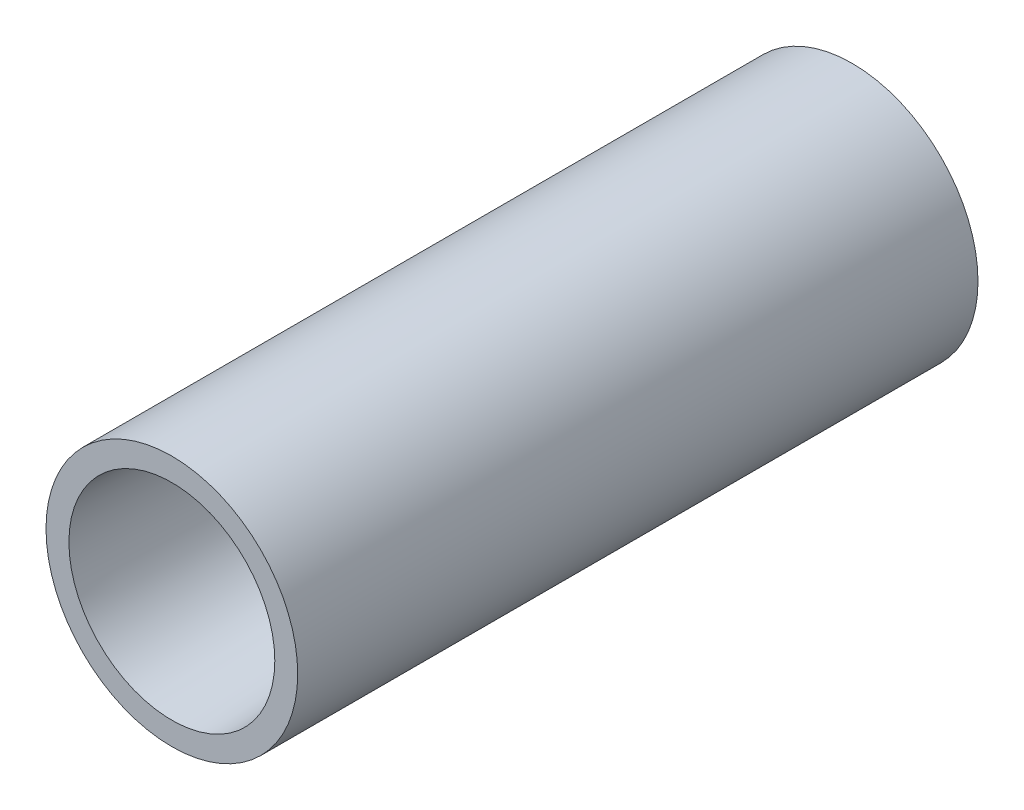
ISO-10303-21;
HEADER;
FILE_DESCRIPTION(('STEP AP214'),'2;1');
FILE_NAME('part.step','',(''),(''),'','','');
FILE_SCHEMA(('AUTOMOTIVE_DESIGN { 1 0 10303 214 1 1 1 1 }'));
ENDSEC;
DATA;
#1=APPLICATION_CONTEXT('core data for automotive mechanical design processes');
#2=APPLICATION_PROTOCOL_DEFINITION('international standard','automotive_design',2000,#1);
#3=PRODUCT_CONTEXT('',#1,'mechanical');
#4=PRODUCT('Part','Part','',(#3));
#5=PRODUCT_RELATED_PRODUCT_CATEGORY('part','',(#4));
#6=PRODUCT_DEFINITION_FORMATION('','',#4);
#7=PRODUCT_DEFINITION_CONTEXT('part definition',#1,'design');
#8=PRODUCT_DEFINITION('design','',#6,#7);
#9=PRODUCT_DEFINITION_SHAPE('','',#8);
#10=(LENGTH_UNIT() NAMED_UNIT(*) SI_UNIT(.MILLI.,.METRE.));
#11=(NAMED_UNIT(*) PLANE_ANGLE_UNIT() SI_UNIT($,.RADIAN.));
#12=(NAMED_UNIT(*) SI_UNIT($,.STERADIAN.) SOLID_ANGLE_UNIT());
#13=UNCERTAINTY_MEASURE_WITH_UNIT(LENGTH_MEASURE(1.E-05),#10,'distance_accuracy_value','');
#14=(GEOMETRIC_REPRESENTATION_CONTEXT(3) GLOBAL_UNCERTAINTY_ASSIGNED_CONTEXT((#13)) GLOBAL_UNIT_ASSIGNED_CONTEXT((#10,
#11,#12)) REPRESENTATION_CONTEXT('',''));
#15=CARTESIAN_POINT('',(0.,0.,0.));
#16=DIRECTION('',(0.,0.,1.));
#17=DIRECTION('',(1.,0.,0.));
#18=AXIS2_PLACEMENT_3D('',#15,#16,#17);
#19=CARTESIAN_POINT('',(0.,0.,15.));
#20=DIRECTION('',(0.,0.,-1.));
#21=DIRECTION('',(-1.,0.,0.));
#22=AXIS2_PLACEMENT_3D('',#19,#20,#21);
#23=CYLINDRICAL_SURFACE('',#22,1.);
#24=CARTESIAN_POINT('',(0.,0.,5.68));
#25=DIRECTION('',(0.,0.,1.));
#26=DIRECTION('',(1.,0.,0.));
#27=AXIS2_PLACEMENT_3D('',#24,#25,#26);
#28=CIRCLE('',#27,1.);
#29=CARTESIAN_POINT('',(1.,0.,5.68));
#30=VERTEX_POINT('',#29);
#31=EDGE_CURVE('E56',#30,#30,#28,.F.);
#32=ORIENTED_EDGE('',*,*,#31,.T.);
#33=EDGE_LOOP('',(#32));
#34=FACE_BOUND('',#33,.T.);
#35=CARTESIAN_POINT('',(0.,0.,9.32));
#36=DIRECTION('',(0.,0.,1.));
#37=DIRECTION('',(1.,0.,0.));
#38=AXIS2_PLACEMENT_3D('',#35,#36,#37);
#39=CIRCLE('',#38,1.);
#40=CARTESIAN_POINT('',(1.,0.,9.32));
#41=VERTEX_POINT('',#40);
#42=EDGE_CURVE('E41',#41,#41,#39,.T.);
#43=ORIENTED_EDGE('',*,*,#42,.T.);
#44=EDGE_LOOP('',(#43));
#45=FACE_BOUND('',#44,.T.);
#46=ADVANCED_FACE('F37',(#34,#45),#23,.F.);
#47=CARTESIAN_POINT('',(0.,0.,15.));
#48=DIRECTION('',(0.,0.,-1.));
#49=DIRECTION('',(-1.,0.,0.));
#50=AXIS2_PLACEMENT_3D('',#47,#48,#49);
#51=CYLINDRICAL_SURFACE('',#50,2.775);
#52=CARTESIAN_POINT('',(0.,0.,15.));
#53=DIRECTION('',(0.,0.,1.));
#54=DIRECTION('',(1.,0.,0.));
#55=AXIS2_PLACEMENT_3D('',#52,#53,#54);
#56=CIRCLE('',#55,2.775);
#57=CARTESIAN_POINT('',(2.775,0.,15.));
#58=VERTEX_POINT('',#57);
#59=EDGE_CURVE('E10',#58,#58,#56,.T.);
#60=ORIENTED_EDGE('',*,*,#59,.F.);
#61=EDGE_LOOP('',(#60));
#62=FACE_BOUND('',#61,.T.);
#63=CARTESIAN_POINT('',(0.,0.,0.));
#64=DIRECTION('',(0.,0.,1.));
#65=DIRECTION('',(1.,0.,0.));
#66=AXIS2_PLACEMENT_3D('',#63,#64,#65);
#67=CIRCLE('',#66,2.775);
#68=CARTESIAN_POINT('',(2.775,0.,0.));
#69=VERTEX_POINT('',#68);
#70=EDGE_CURVE('E46',#69,#69,#67,.T.);
#71=ORIENTED_EDGE('',*,*,#70,.T.);
#72=EDGE_LOOP('',(#71));
#73=FACE_BOUND('',#72,.T.);
#74=ADVANCED_FACE('F39',(#62,#73),#51,.T.);
#75=CARTESIAN_POINT('',(0.,0.,15.));
#76=DIRECTION('',(0.,0.,1.));
#77=DIRECTION('',(1.,0.,0.));
#78=AXIS2_PLACEMENT_3D('',#75,#76,#77);
#79=PLANE('',#78);
#80=CARTESIAN_POINT('',(0.,0.,15.));
#81=DIRECTION('',(0.,0.,1.));
#82=DIRECTION('',(1.,0.,0.));
#83=AXIS2_PLACEMENT_3D('',#80,#81,#82);
#84=CIRCLE('',#83,2.27);
#85=CARTESIAN_POINT('',(2.27,0.,15.));
#86=VERTEX_POINT('',#85);
#87=EDGE_CURVE('E71',#86,#86,#84,.T.);
#88=ORIENTED_EDGE('',*,*,#87,.F.);
#89=EDGE_LOOP('',(#88));
#90=FACE_BOUND('',#89,.T.);
#91=ORIENTED_EDGE('',*,*,#59,.T.);
#92=EDGE_LOOP('',(#91));
#93=FACE_BOUND('',#92,.T.);
#94=ADVANCED_FACE('F82',(#90,#93),#79,.T.);
#95=CARTESIAN_POINT('',(0.,0.,0.));
#96=DIRECTION('',(0.,0.,1.));
#97=DIRECTION('',(1.,0.,0.));
#98=AXIS2_PLACEMENT_3D('',#95,#96,#97);
#99=PLANE('',#98);
#100=CARTESIAN_POINT('',(0.,0.,0.));
#101=DIRECTION('',(0.,0.,1.));
#102=DIRECTION('',(1.,0.,0.));
#103=AXIS2_PLACEMENT_3D('',#100,#101,#102);
#104=CIRCLE('',#103,2.27);
#105=CARTESIAN_POINT('',(2.27,0.,0.));
#106=VERTEX_POINT('',#105);
#107=EDGE_CURVE('E59',#106,#106,#104,.T.);
#108=ORIENTED_EDGE('',*,*,#107,.T.);
#109=EDGE_LOOP('',(#108));
#110=FACE_BOUND('',#109,.T.);
#111=ORIENTED_EDGE('',*,*,#70,.F.);
#112=EDGE_LOOP('',(#111));
#113=FACE_BOUND('',#112,.T.);
#114=ADVANCED_FACE('F84',(#110,#113),#99,.F.);
#115=CARTESIAN_POINT('',(0.,0.,0.));
#116=DIRECTION('',(0.,0.,-1.));
#117=DIRECTION('',(1.,0.,0.));
#118=AXIS2_PLACEMENT_3D('',#115,#116,#117);
#119=CONICAL_SURFACE('',#118,2.27,0.0536514212063058);
#120=CARTESIAN_POINT('',(0.,0.,5.68));
#121=DIRECTION('',(0.,0.,1.));
#122=DIRECTION('',(1.,0.,0.));
#123=AXIS2_PLACEMENT_3D('',#120,#121,#122);
#124=CIRCLE('',#123,1.9649671949344);
#125=CARTESIAN_POINT('',(1.9649671949344,0.,5.68));
#126=VERTEX_POINT('',#125);
#127=EDGE_CURVE('E52',#126,#126,#124,.T.);
#128=ORIENTED_EDGE('',*,*,#127,.T.);
#129=EDGE_LOOP('',(#128));
#130=FACE_BOUND('',#129,.T.);
#131=ORIENTED_EDGE('',*,*,#107,.F.);
#132=EDGE_LOOP('',(#131));
#133=FACE_BOUND('',#132,.T.);
#134=ADVANCED_FACE('F90',(#130,#133),#119,.F.);
#135=CARTESIAN_POINT('',(0.,0.,5.68));
#136=DIRECTION('',(0.,0.,1.));
#137=DIRECTION('',(1.,0.,0.));
#138=AXIS2_PLACEMENT_3D('',#135,#136,#137);
#139=PLANE('',#138);
#140=ORIENTED_EDGE('',*,*,#31,.F.);
#141=EDGE_LOOP('',(#140));
#142=FACE_BOUND('',#141,.T.);
#143=ORIENTED_EDGE('',*,*,#127,.F.);
#144=EDGE_LOOP('',(#143));
#145=FACE_BOUND('',#144,.T.);
#146=ADVANCED_FACE('F101',(#142,#145),#139,.F.);
#147=CARTESIAN_POINT('',(0.,0.,15.));
#148=DIRECTION('',(0.,0.,1.));
#149=DIRECTION('',(1.,0.,0.));
#150=AXIS2_PLACEMENT_3D('',#147,#148,#149);
#151=CONICAL_SURFACE('',#150,2.27,0.0536514212063058);
#152=CARTESIAN_POINT('',(0.,0.,9.32));
#153=DIRECTION('',(0.,0.,1.));
#154=DIRECTION('',(1.,0.,0.));
#155=AXIS2_PLACEMENT_3D('',#152,#153,#154);
#156=CIRCLE('',#155,1.9649671949344);
#157=CARTESIAN_POINT('',(1.9649671949344,0.,9.32));
#158=VERTEX_POINT('',#157);
#159=EDGE_CURVE('E66',#158,#158,#156,.T.);
#160=ORIENTED_EDGE('',*,*,#159,.F.);
#161=EDGE_LOOP('',(#160));
#162=FACE_BOUND('',#161,.T.);
#163=ORIENTED_EDGE('',*,*,#87,.T.);
#164=EDGE_LOOP('',(#163));
#165=FACE_BOUND('',#164,.T.);
#166=ADVANCED_FACE('F80',(#162,#165),#151,.F.);
#167=CARTESIAN_POINT('',(0.,0.,9.32));
#168=DIRECTION('',(0.,0.,1.));
#169=DIRECTION('',(1.,0.,0.));
#170=AXIS2_PLACEMENT_3D('',#167,#168,#169);
#171=PLANE('',#170);
#172=ORIENTED_EDGE('',*,*,#42,.F.);
#173=EDGE_LOOP('',(#172));
#174=FACE_BOUND('',#173,.T.);
#175=ORIENTED_EDGE('',*,*,#159,.T.);
#176=EDGE_LOOP('',(#175));
#177=FACE_BOUND('',#176,.T.);
#178=ADVANCED_FACE('F129',(#174,#177),#171,.T.);
#179=CLOSED_SHELL('',(#46,#74,#94,#114,#134,#146,#166,#178));
#180=MANIFOLD_SOLID_BREP('B2',#179);
#181=ADVANCED_BREP_SHAPE_REPRESENTATION('',(#18,#180),#14);
#182=SHAPE_DEFINITION_REPRESENTATION(#9,#181);
ENDSEC;
END-ISO-10303-21;
